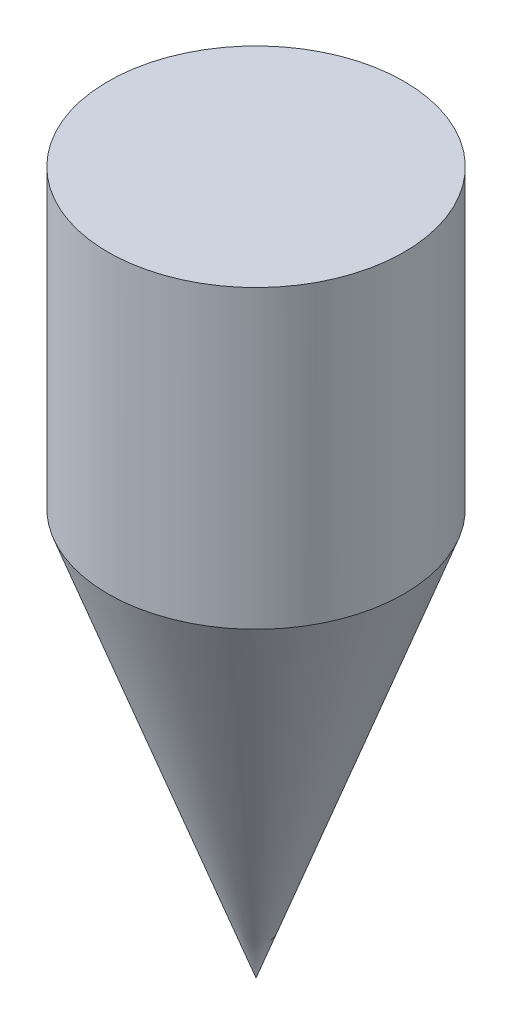
ISO-10303-21;
HEADER;
FILE_DESCRIPTION(('STEP AP214'),'2;1');
FILE_NAME('part.step','',(''),(''),'','','');
FILE_SCHEMA(('AUTOMOTIVE_DESIGN { 1 0 10303 214 1 1 1 1 }'));
ENDSEC;
DATA;
#1=APPLICATION_CONTEXT('core data for automotive mechanical design processes');
#2=APPLICATION_PROTOCOL_DEFINITION('international standard','automotive_design',2000,#1);
#3=PRODUCT_CONTEXT('',#1,'mechanical');
#4=PRODUCT('Part','Part','',(#3));
#5=PRODUCT_RELATED_PRODUCT_CATEGORY('part','',(#4));
#6=PRODUCT_DEFINITION_FORMATION('','',#4);
#7=PRODUCT_DEFINITION_CONTEXT('part definition',#1,'design');
#8=PRODUCT_DEFINITION('design','',#6,#7);
#9=PRODUCT_DEFINITION_SHAPE('','',#8);
#10=(LENGTH_UNIT() NAMED_UNIT(*) SI_UNIT(.MILLI.,.METRE.));
#11=(NAMED_UNIT(*) PLANE_ANGLE_UNIT() SI_UNIT($,.RADIAN.));
#12=(NAMED_UNIT(*) SI_UNIT($,.STERADIAN.) SOLID_ANGLE_UNIT());
#13=UNCERTAINTY_MEASURE_WITH_UNIT(LENGTH_MEASURE(1.E-05),#10,'distance_accuracy_value','');
#14=(GEOMETRIC_REPRESENTATION_CONTEXT(3) GLOBAL_UNCERTAINTY_ASSIGNED_CONTEXT((#13)) GLOBAL_UNIT_ASSIGNED_CONTEXT((#10,
#11,#12)) REPRESENTATION_CONTEXT('',''));
#15=CARTESIAN_POINT('',(0.,0.,0.));
#16=DIRECTION('',(0.,0.,1.));
#17=DIRECTION('',(1.,0.,0.));
#18=AXIS2_PLACEMENT_3D('',#15,#16,#17);
#19=CARTESIAN_POINT('',(-5.,37.183691588591,0.));
#20=DIRECTION('',(0.,-1.,0.));
#21=DIRECTION('',(0.,0.,-1.));
#22=AXIS2_PLACEMENT_3D('',#19,#20,#21);
#23=PLANE('',#22);
#24=CARTESIAN_POINT('',(0.,37.183691588591,0.));
#25=DIRECTION('',(0.,-1.,0.));
#26=DIRECTION('',(0.,0.,-1.));
#27=AXIS2_PLACEMENT_3D('',#24,#25,#26);
#28=CIRCLE('',#27,5.);
#29=CARTESIAN_POINT('',(0.,37.183691588591,-5.));
#30=VERTEX_POINT('',#29);
#31=EDGE_CURVE('E11',#30,#30,#28,.T.);
#32=ORIENTED_EDGE('',*,*,#31,.F.);
#33=EDGE_LOOP('',(#32));
#34=FACE_BOUND('',#33,.T.);
#35=ADVANCED_FACE('F33',(#34),#23,.F.);
#36=CARTESIAN_POINT('',(0.,0.,0.));
#37=DIRECTION('',(0.,-1.,0.));
#38=DIRECTION('',(0.,0.,-1.));
#39=AXIS2_PLACEMENT_3D('',#36,#37,#38);
#40=CYLINDRICAL_SURFACE('',#39,5.);
#41=CARTESIAN_POINT('',(0.,27.183691588591,0.));
#42=DIRECTION('',(0.,-1.,0.));
#43=DIRECTION('',(0.,0.,-1.));
#44=AXIS2_PLACEMENT_3D('',#41,#42,#43);
#45=CIRCLE('',#44,5.);
#46=CARTESIAN_POINT('',(0.,27.183691588591,-5.));
#47=VERTEX_POINT('',#46);
#48=EDGE_CURVE('E39',#47,#47,#45,.T.);
#49=ORIENTED_EDGE('',*,*,#48,.F.);
#50=EDGE_LOOP('',(#49));
#51=FACE_BOUND('',#50,.T.);
#52=ORIENTED_EDGE('',*,*,#31,.T.);
#53=EDGE_LOOP('',(#52));
#54=FACE_BOUND('',#53,.T.);
#55=ADVANCED_FACE('F45',(#51,#54),#40,.T.);
#56=CARTESIAN_POINT('',(0.,27.183691588591,0.));
#57=DIRECTION('',(0.,1.,0.));
#58=DIRECTION('',(0.,0.,1.));
#59=AXIS2_PLACEMENT_3D('',#56,#57,#58);
#60=CONICAL_SURFACE('',#59,5.,0.349065850398868);
#61=CARTESIAN_POINT('',(0.,13.4463044913179,0.));
#62=VERTEX_POINT('',#61);
#63=VERTEX_LOOP('',#62);
#64=FACE_BOUND('',#63,.T.);
#65=ORIENTED_EDGE('',*,*,#48,.T.);
#66=EDGE_LOOP('',(#65));
#67=FACE_BOUND('',#66,.T.);
#68=ADVANCED_FACE('F42',(#64,#67),#60,.T.);
#69=CLOSED_SHELL('',(#35,#55,#68));
#70=MANIFOLD_SOLID_BREP('B2',#69);
#71=ADVANCED_BREP_SHAPE_REPRESENTATION('',(#18,#70),#14);
#72=SHAPE_DEFINITION_REPRESENTATION(#9,#71);
ENDSEC;
END-ISO-10303-21;
